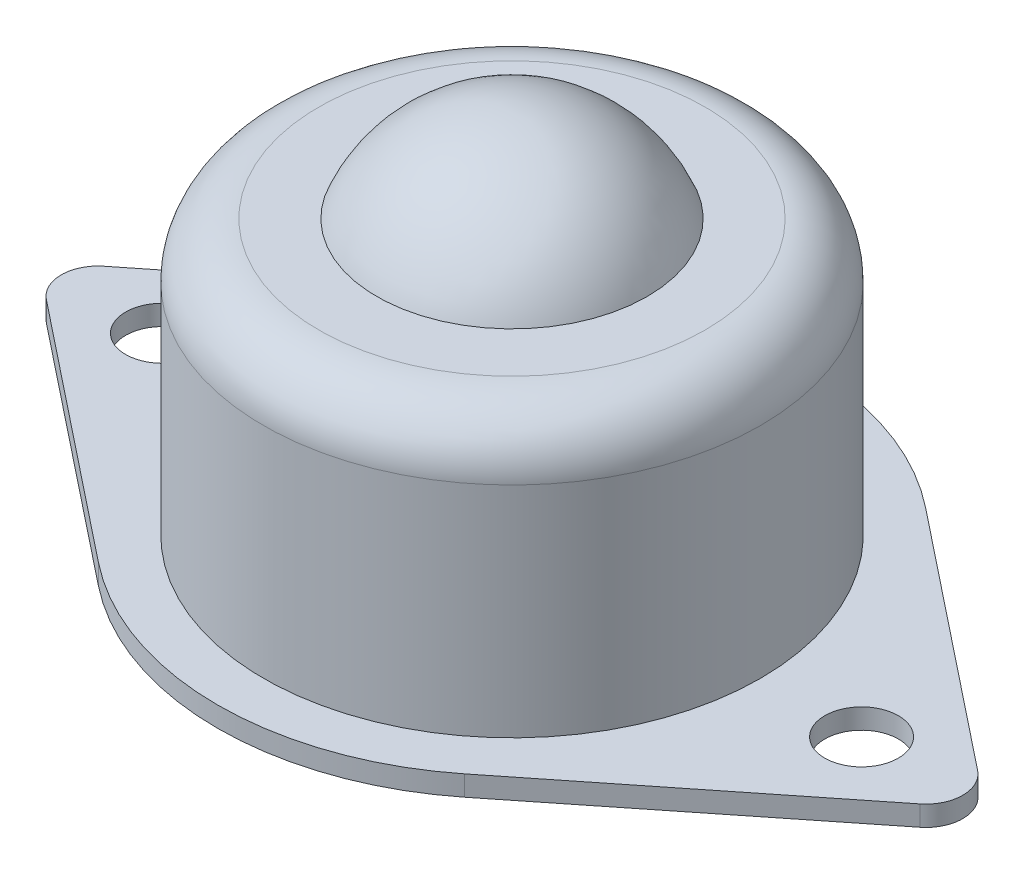
ISO-10303-21;
HEADER;
FILE_DESCRIPTION(('STEP AP214'),'2;1');
FILE_NAME('part.step','',(''),(''),'','','');
FILE_SCHEMA(('AUTOMOTIVE_DESIGN { 1 0 10303 214 1 1 1 1 }'));
ENDSEC;
DATA;
#1=APPLICATION_CONTEXT('core data for automotive mechanical design processes');
#2=APPLICATION_PROTOCOL_DEFINITION('international standard','automotive_design',2000,#1);
#3=PRODUCT_CONTEXT('',#1,'mechanical');
#4=PRODUCT('Part','Part','',(#3));
#5=PRODUCT_RELATED_PRODUCT_CATEGORY('part','',(#4));
#6=PRODUCT_DEFINITION_FORMATION('','',#4);
#7=PRODUCT_DEFINITION_CONTEXT('part definition',#1,'design');
#8=PRODUCT_DEFINITION('design','',#6,#7);
#9=PRODUCT_DEFINITION_SHAPE('','',#8);
#10=(LENGTH_UNIT() NAMED_UNIT(*) SI_UNIT(.MILLI.,.METRE.));
#11=(NAMED_UNIT(*) PLANE_ANGLE_UNIT() SI_UNIT($,.RADIAN.));
#12=(NAMED_UNIT(*) SI_UNIT($,.STERADIAN.) SOLID_ANGLE_UNIT());
#13=UNCERTAINTY_MEASURE_WITH_UNIT(LENGTH_MEASURE(1.E-05),#10,'distance_accuracy_value','');
#14=(GEOMETRIC_REPRESENTATION_CONTEXT(3) GLOBAL_UNCERTAINTY_ASSIGNED_CONTEXT((#13)) GLOBAL_UNIT_ASSIGNED_CONTEXT((#10,
#11,#12)) REPRESENTATION_CONTEXT('',''));
#15=CARTESIAN_POINT('',(0.,0.,0.));
#16=DIRECTION('',(0.,0.,1.));
#17=DIRECTION('',(1.,0.,0.));
#18=AXIS2_PLACEMENT_3D('',#15,#16,#17);
#19=CARTESIAN_POINT('',(0.,1.1,0.));
#20=DIRECTION('',(0.,1.,0.));
#21=DIRECTION('',(0.,0.,1.));
#22=AXIS2_PLACEMENT_3D('',#19,#20,#21);
#23=PLANE('',#22);
#24=CARTESIAN_POINT('',(19.,1.1,0.));
#25=DIRECTION('',(0.,1.,0.));
#26=DIRECTION('',(0.,0.,-1.));
#27=AXIS2_PLACEMENT_3D('',#24,#25,#26);
#28=CIRCLE('',#27,2.);
#29=CARTESIAN_POINT('',(19.,1.1,-2.00000000000001));
#30=VERTEX_POINT('',#29);
#31=EDGE_CURVE('E184',#30,#30,#28,.T.);
#32=ORIENTED_EDGE('',*,*,#31,.F.);
#33=EDGE_LOOP('',(#32));
#34=FACE_BOUND('',#33,.T.);
#35=CARTESIAN_POINT('',(0.,1.1,0.));
#36=DIRECTION('',(0.,1.,0.));
#37=DIRECTION('',(0.,0.,1.));
#38=AXIS2_PLACEMENT_3D('',#35,#36,#37);
#39=CIRCLE('',#38,16.);
#40=CARTESIAN_POINT('',(9.95555555555555,1.1,-12.5254506338194));
#41=VERTEX_POINT('',#40);
#42=CARTESIAN_POINT('',(-9.95555555555556,1.1,-12.5254506338194));
#43=VERTEX_POINT('',#42);
#44=EDGE_CURVE('E147',#41,#43,#39,.T.);
#45=ORIENTED_EDGE('',*,*,#44,.T.);
#46=DIRECTION('',(-0.782840664613713,0.,0.622222222222222));
#47=VECTOR('',#46,1.);
#48=CARTESIAN_POINT('',(-9.95555555555556,1.1,-12.5254506338194));
#49=LINE('',#48,#47);
#50=CARTESIAN_POINT('',(-23.7444444444444,1.1,-1.56568132922743));
#51=VERTEX_POINT('',#50);
#52=EDGE_CURVE('E95',#43,#51,#49,.T.);
#53=ORIENTED_EDGE('',*,*,#52,.T.);
#54=CARTESIAN_POINT('',(-22.5,1.1,0.));
#55=DIRECTION('',(0.,1.,0.));
#56=DIRECTION('',(0.,0.,1.));
#57=AXIS2_PLACEMENT_3D('',#54,#55,#56);
#58=CIRCLE('',#57,2.);
#59=CARTESIAN_POINT('',(-23.7444444444444,1.1,1.56568132922743));
#60=VERTEX_POINT('',#59);
#61=EDGE_CURVE('E162',#51,#60,#58,.T.);
#62=ORIENTED_EDGE('',*,*,#61,.T.);
#63=DIRECTION('',(0.782840664613713,0.,0.622222222222222));
#64=VECTOR('',#63,1.);
#65=CARTESIAN_POINT('',(-9.95555555555556,1.1,12.5254506338194));
#66=LINE('',#65,#64);
#67=CARTESIAN_POINT('',(-9.95555555555556,1.1,12.5254506338194));
#68=VERTEX_POINT('',#67);
#69=EDGE_CURVE('E175',#60,#68,#66,.T.);
#70=ORIENTED_EDGE('',*,*,#69,.T.);
#71=CARTESIAN_POINT('',(0.,1.1,0.));
#72=DIRECTION('',(0.,1.,0.));
#73=DIRECTION('',(0.,0.,1.));
#74=AXIS2_PLACEMENT_3D('',#71,#72,#73);
#75=CIRCLE('',#74,16.);
#76=CARTESIAN_POINT('',(9.95555555555555,1.1,12.5254506338194));
#77=VERTEX_POINT('',#76);
#78=EDGE_CURVE('E114',#68,#77,#75,.T.);
#79=ORIENTED_EDGE('',*,*,#78,.T.);
#80=DIRECTION('',(0.782840664613713,0.,-0.622222222222222));
#81=VECTOR('',#80,1.);
#82=CARTESIAN_POINT('',(9.95555555555556,1.1,12.5254506338194));
#83=LINE('',#82,#81);
#84=CARTESIAN_POINT('',(23.7444444444444,1.1,1.56568132922743));
#85=VERTEX_POINT('',#84);
#86=EDGE_CURVE('E108',#77,#85,#83,.T.);
#87=ORIENTED_EDGE('',*,*,#86,.T.);
#88=CARTESIAN_POINT('',(22.5,1.1,0.));
#89=DIRECTION('',(0.,1.,0.));
#90=DIRECTION('',(0.,0.,-1.));
#91=AXIS2_PLACEMENT_3D('',#88,#89,#90);
#92=CIRCLE('',#91,2.00000000000001);
#93=CARTESIAN_POINT('',(23.7444444444445,1.1,-1.56568132922744));
#94=VERTEX_POINT('',#93);
#95=EDGE_CURVE('E112',#85,#94,#92,.T.);
#96=ORIENTED_EDGE('',*,*,#95,.T.);
#97=DIRECTION('',(-0.782840664613713,0.,-0.622222222222222));
#98=VECTOR('',#97,1.);
#99=CARTESIAN_POINT('',(9.95555555555555,1.1,-12.5254506338194));
#100=LINE('',#99,#98);
#101=EDGE_CURVE('E52',#94,#41,#100,.T.);
#102=ORIENTED_EDGE('',*,*,#101,.T.);
#103=EDGE_LOOP('',(#45,#53,#62,#70,#79,#87,#96,#102));
#104=FACE_BOUND('',#103,.T.);
#105=CARTESIAN_POINT('',(-19.,1.1,0.));
#106=DIRECTION('',(0.,1.,0.));
#107=DIRECTION('',(0.,0.,1.));
#108=AXIS2_PLACEMENT_3D('',#105,#106,#107);
#109=CIRCLE('',#108,2.);
#110=CARTESIAN_POINT('',(-19.,1.1,2.));
#111=VERTEX_POINT('',#110);
#112=EDGE_CURVE('E136',#111,#111,#109,.T.);
#113=ORIENTED_EDGE('',*,*,#112,.F.);
#114=EDGE_LOOP('',(#113));
#115=FACE_BOUND('',#114,.T.);
#116=CARTESIAN_POINT('',(0.,1.1,0.));
#117=DIRECTION('',(0.,-1.,0.));
#118=DIRECTION('',(1.,0.,0.));
#119=AXIS2_PLACEMENT_3D('',#116,#117,#118);
#120=CIRCLE('',#119,13.5);
#121=CARTESIAN_POINT('',(13.5,1.1,0.));
#122=VERTEX_POINT('',#121);
#123=EDGE_CURVE('E201',#122,#122,#120,.T.);
#124=ORIENTED_EDGE('',*,*,#123,.T.);
#125=EDGE_LOOP('',(#124));
#126=FACE_BOUND('',#125,.T.);
#127=ADVANCED_FACE('F35',(#34,#104,#115,#126),#23,.T.);
#128=CARTESIAN_POINT('',(0.,0.,0.));
#129=DIRECTION('',(0.,1.,0.));
#130=DIRECTION('',(0.,0.,1.));
#131=AXIS2_PLACEMENT_3D('',#128,#129,#130);
#132=PLANE('',#131);
#133=CARTESIAN_POINT('',(-19.,0.,0.));
#134=DIRECTION('',(0.,1.,0.));
#135=DIRECTION('',(0.,0.,1.));
#136=AXIS2_PLACEMENT_3D('',#133,#134,#135);
#137=CIRCLE('',#136,2.);
#138=CARTESIAN_POINT('',(-19.,0.,2.));
#139=VERTEX_POINT('',#138);
#140=EDGE_CURVE('E181',#139,#139,#137,.T.);
#141=ORIENTED_EDGE('',*,*,#140,.T.);
#142=EDGE_LOOP('',(#141));
#143=FACE_BOUND('',#142,.T.);
#144=CARTESIAN_POINT('',(0.,0.,0.));
#145=DIRECTION('',(0.,1.,0.));
#146=DIRECTION('',(0.,0.,1.));
#147=AXIS2_PLACEMENT_3D('',#144,#145,#146);
#148=CIRCLE('',#147,16.);
#149=CARTESIAN_POINT('',(9.95555555555555,0.,-12.5254506338194));
#150=VERTEX_POINT('',#149);
#151=CARTESIAN_POINT('',(-9.95555555555556,0.,-12.5254506338194));
#152=VERTEX_POINT('',#151);
#153=EDGE_CURVE('E132',#150,#152,#148,.T.);
#154=ORIENTED_EDGE('',*,*,#153,.F.);
#155=DIRECTION('',(-0.782840664613713,0.,-0.622222222222222));
#156=VECTOR('',#155,1.);
#157=CARTESIAN_POINT('',(9.95555555555555,0.,-12.5254506338194));
#158=LINE('',#157,#156);
#159=CARTESIAN_POINT('',(23.7444444444445,0.,-1.56568132922744));
#160=VERTEX_POINT('',#159);
#161=EDGE_CURVE('E87',#160,#150,#158,.T.);
#162=ORIENTED_EDGE('',*,*,#161,.F.);
#163=CARTESIAN_POINT('',(22.5,0.,0.));
#164=DIRECTION('',(0.,1.,0.));
#165=DIRECTION('',(0.,0.,-1.));
#166=AXIS2_PLACEMENT_3D('',#163,#164,#165);
#167=CIRCLE('',#166,2.00000000000001);
#168=CARTESIAN_POINT('',(23.7444444444444,0.,1.56568132922743));
#169=VERTEX_POINT('',#168);
#170=EDGE_CURVE('E81',#169,#160,#167,.T.);
#171=ORIENTED_EDGE('',*,*,#170,.F.);
#172=DIRECTION('',(0.782840664613713,0.,-0.622222222222222));
#173=VECTOR('',#172,1.);
#174=CARTESIAN_POINT('',(9.95555555555556,0.,12.5254506338194));
#175=LINE('',#174,#173);
#176=CARTESIAN_POINT('',(9.95555555555555,0.,12.5254506338194));
#177=VERTEX_POINT('',#176);
#178=EDGE_CURVE('E122',#177,#169,#175,.T.);
#179=ORIENTED_EDGE('',*,*,#178,.F.);
#180=CARTESIAN_POINT('',(0.,0.,0.));
#181=DIRECTION('',(0.,1.,0.));
#182=DIRECTION('',(0.,0.,1.));
#183=AXIS2_PLACEMENT_3D('',#180,#181,#182);
#184=CIRCLE('',#183,16.);
#185=CARTESIAN_POINT('',(-9.95555555555556,0.,12.5254506338194));
#186=VERTEX_POINT('',#185);
#187=EDGE_CURVE('E142',#186,#177,#184,.T.);
#188=ORIENTED_EDGE('',*,*,#187,.F.);
#189=DIRECTION('',(0.782840664613713,0.,0.622222222222222));
#190=VECTOR('',#189,1.);
#191=CARTESIAN_POINT('',(-9.95555555555556,0.,12.5254506338194));
#192=LINE('',#191,#190);
#193=CARTESIAN_POINT('',(-23.7444444444444,0.,1.56568132922743));
#194=VERTEX_POINT('',#193);
#195=EDGE_CURVE('E140',#194,#186,#192,.T.);
#196=ORIENTED_EDGE('',*,*,#195,.F.);
#197=CARTESIAN_POINT('',(-22.5,0.,0.));
#198=DIRECTION('',(0.,1.,0.));
#199=DIRECTION('',(0.,0.,1.));
#200=AXIS2_PLACEMENT_3D('',#197,#198,#199);
#201=CIRCLE('',#200,2.);
#202=CARTESIAN_POINT('',(-23.7444444444444,0.,-1.56568132922743));
#203=VERTEX_POINT('',#202);
#204=EDGE_CURVE('E138',#203,#194,#201,.T.);
#205=ORIENTED_EDGE('',*,*,#204,.F.);
#206=DIRECTION('',(-0.782840664613713,0.,0.622222222222222));
#207=VECTOR('',#206,1.);
#208=CARTESIAN_POINT('',(-9.95555555555556,0.,-12.5254506338194));
#209=LINE('',#208,#207);
#210=EDGE_CURVE('E135',#152,#203,#209,.T.);
#211=ORIENTED_EDGE('',*,*,#210,.F.);
#212=EDGE_LOOP('',(#154,#162,#171,#179,#188,#196,#205,#211));
#213=FACE_BOUND('',#212,.T.);
#214=CARTESIAN_POINT('',(19.,0.,0.));
#215=DIRECTION('',(0.,1.,0.));
#216=DIRECTION('',(0.,0.,-1.));
#217=AXIS2_PLACEMENT_3D('',#214,#215,#216);
#218=CIRCLE('',#217,2.);
#219=CARTESIAN_POINT('',(19.,0.,-2.00000000000001));
#220=VERTEX_POINT('',#219);
#221=EDGE_CURVE('E187',#220,#220,#218,.T.);
#222=ORIENTED_EDGE('',*,*,#221,.T.);
#223=EDGE_LOOP('',(#222));
#224=FACE_BOUND('',#223,.T.);
#225=ADVANCED_FACE('F166',(#143,#213,#224),#132,.F.);
#226=CARTESIAN_POINT('',(0.,1.1,0.));
#227=DIRECTION('',(0.,-1.,0.));
#228=DIRECTION('',(0.,0.,-1.));
#229=AXIS2_PLACEMENT_3D('',#226,#227,#228);
#230=CYLINDRICAL_SURFACE('',#229,16.);
#231=ORIENTED_EDGE('',*,*,#153,.T.);
#232=DIRECTION('',(0.,-1.,0.));
#233=VECTOR('',#232,1.);
#234=CARTESIAN_POINT('',(-9.95555555555556,1.1,-12.5254506338194));
#235=LINE('',#234,#233);
#236=EDGE_CURVE('E11',#43,#152,#235,.T.);
#237=ORIENTED_EDGE('',*,*,#236,.F.);
#238=ORIENTED_EDGE('',*,*,#44,.F.);
#239=DIRECTION('',(0.,-1.,0.));
#240=VECTOR('',#239,1.);
#241=CARTESIAN_POINT('',(9.95555555555555,1.1,-12.5254506338194));
#242=LINE('',#241,#240);
#243=EDGE_CURVE('E128',#41,#150,#242,.T.);
#244=ORIENTED_EDGE('',*,*,#243,.T.);
#245=EDGE_LOOP('',(#231,#237,#238,#244));
#246=FACE_BOUND('',#245,.T.);
#247=ADVANCED_FACE('F37',(#246),#230,.T.);
#248=CARTESIAN_POINT('',(-9.95555555555556,1.1,-12.5254506338194));
#249=DIRECTION('',(0.622222222222222,0.,0.782840664613713));
#250=DIRECTION('',(0.782840664613713,0.,-0.622222222222222));
#251=AXIS2_PLACEMENT_3D('',#248,#249,#250);
#252=PLANE('',#251);
#253=ORIENTED_EDGE('',*,*,#210,.T.);
#254=DIRECTION('',(0.,-1.,0.));
#255=VECTOR('',#254,1.);
#256=CARTESIAN_POINT('',(-23.7444444444444,1.1,-1.56568132922743));
#257=LINE('',#256,#255);
#258=EDGE_CURVE('E44',#51,#203,#257,.T.);
#259=ORIENTED_EDGE('',*,*,#258,.F.);
#260=ORIENTED_EDGE('',*,*,#52,.F.);
#261=ORIENTED_EDGE('',*,*,#236,.T.);
#262=EDGE_LOOP('',(#253,#259,#260,#261));
#263=FACE_BOUND('',#262,.T.);
#264=ADVANCED_FACE('F257',(#263),#252,.F.);
#265=CARTESIAN_POINT('',(-22.5,1.1,0.));
#266=DIRECTION('',(0.,-1.,0.));
#267=DIRECTION('',(0.,0.,-1.));
#268=AXIS2_PLACEMENT_3D('',#265,#266,#267);
#269=CYLINDRICAL_SURFACE('',#268,2.);
#270=ORIENTED_EDGE('',*,*,#204,.T.);
#271=DIRECTION('',(0.,-1.,0.));
#272=VECTOR('',#271,1.);
#273=CARTESIAN_POINT('',(-23.7444444444444,1.1,1.56568132922743));
#274=LINE('',#273,#272);
#275=EDGE_CURVE('E154',#60,#194,#274,.T.);
#276=ORIENTED_EDGE('',*,*,#275,.F.);
#277=ORIENTED_EDGE('',*,*,#61,.F.);
#278=ORIENTED_EDGE('',*,*,#258,.T.);
#279=EDGE_LOOP('',(#270,#276,#277,#278));
#280=FACE_BOUND('',#279,.T.);
#281=ADVANCED_FACE('F160',(#280),#269,.T.);
#282=CARTESIAN_POINT('',(-9.95555555555556,1.1,12.5254506338194));
#283=DIRECTION('',(0.622222222222222,0.,-0.782840664613713));
#284=DIRECTION('',(-0.782840664613713,0.,-0.622222222222222));
#285=AXIS2_PLACEMENT_3D('',#282,#283,#284);
#286=PLANE('',#285);
#287=ORIENTED_EDGE('',*,*,#195,.T.);
#288=DIRECTION('',(0.,-1.,0.));
#289=VECTOR('',#288,1.);
#290=CARTESIAN_POINT('',(-9.95555555555556,1.1,12.5254506338194));
#291=LINE('',#290,#289);
#292=EDGE_CURVE('E151',#68,#186,#291,.T.);
#293=ORIENTED_EDGE('',*,*,#292,.F.);
#294=ORIENTED_EDGE('',*,*,#69,.F.);
#295=ORIENTED_EDGE('',*,*,#275,.T.);
#296=EDGE_LOOP('',(#287,#293,#294,#295));
#297=FACE_BOUND('',#296,.T.);
#298=ADVANCED_FACE('F171',(#297),#286,.F.);
#299=CARTESIAN_POINT('',(0.,1.1,0.));
#300=DIRECTION('',(0.,-1.,0.));
#301=DIRECTION('',(0.,0.,-1.));
#302=AXIS2_PLACEMENT_3D('',#299,#300,#301);
#303=CYLINDRICAL_SURFACE('',#302,16.);
#304=ORIENTED_EDGE('',*,*,#187,.T.);
#305=DIRECTION('',(0.,-1.,0.));
#306=VECTOR('',#305,1.);
#307=CARTESIAN_POINT('',(9.95555555555555,1.1,12.5254506338194));
#308=LINE('',#307,#306);
#309=EDGE_CURVE('E123',#77,#177,#308,.T.);
#310=ORIENTED_EDGE('',*,*,#309,.F.);
#311=ORIENTED_EDGE('',*,*,#78,.F.);
#312=ORIENTED_EDGE('',*,*,#292,.T.);
#313=EDGE_LOOP('',(#304,#310,#311,#312));
#314=FACE_BOUND('',#313,.T.);
#315=ADVANCED_FACE('F174',(#314),#303,.T.);
#316=CARTESIAN_POINT('',(9.95555555555556,1.1,12.5254506338194));
#317=DIRECTION('',(-0.622222222222222,0.,-0.782840664613713));
#318=DIRECTION('',(-0.782840664613713,0.,0.622222222222222));
#319=AXIS2_PLACEMENT_3D('',#316,#317,#318);
#320=PLANE('',#319);
#321=ORIENTED_EDGE('',*,*,#178,.T.);
#322=DIRECTION('',(0.,-1.,0.));
#323=VECTOR('',#322,1.);
#324=CARTESIAN_POINT('',(23.7444444444444,1.1,1.56568132922743));
#325=LINE('',#324,#323);
#326=EDGE_CURVE('E119',#85,#169,#325,.T.);
#327=ORIENTED_EDGE('',*,*,#326,.F.);
#328=ORIENTED_EDGE('',*,*,#86,.F.);
#329=ORIENTED_EDGE('',*,*,#309,.T.);
#330=EDGE_LOOP('',(#321,#327,#328,#329));
#331=FACE_BOUND('',#330,.T.);
#332=ADVANCED_FACE('F120',(#331),#320,.F.);
#333=CARTESIAN_POINT('',(22.5,1.1,0.));
#334=DIRECTION('',(0.,-1.,0.));
#335=DIRECTION('',(0.,0.,-1.));
#336=AXIS2_PLACEMENT_3D('',#333,#334,#335);
#337=CYLINDRICAL_SURFACE('',#336,2.00000000000001);
#338=ORIENTED_EDGE('',*,*,#170,.T.);
#339=DIRECTION('',(0.,-1.,0.));
#340=VECTOR('',#339,1.);
#341=CARTESIAN_POINT('',(23.7444444444445,1.1,-1.56568132922744));
#342=LINE('',#341,#340);
#343=EDGE_CURVE('E124',#94,#160,#342,.T.);
#344=ORIENTED_EDGE('',*,*,#343,.F.);
#345=ORIENTED_EDGE('',*,*,#95,.F.);
#346=ORIENTED_EDGE('',*,*,#326,.T.);
#347=EDGE_LOOP('',(#338,#344,#345,#346));
#348=FACE_BOUND('',#347,.T.);
#349=ADVANCED_FACE('F126',(#348),#337,.T.);
#350=CARTESIAN_POINT('',(9.95555555555555,1.1,-12.5254506338194));
#351=DIRECTION('',(-0.622222222222222,0.,0.782840664613713));
#352=DIRECTION('',(0.782840664613713,0.,0.622222222222222));
#353=AXIS2_PLACEMENT_3D('',#350,#351,#352);
#354=PLANE('',#353);
#355=ORIENTED_EDGE('',*,*,#161,.T.);
#356=ORIENTED_EDGE('',*,*,#243,.F.);
#357=ORIENTED_EDGE('',*,*,#101,.F.);
#358=ORIENTED_EDGE('',*,*,#343,.T.);
#359=EDGE_LOOP('',(#355,#356,#357,#358));
#360=FACE_BOUND('',#359,.T.);
#361=ADVANCED_FACE('F245',(#360),#354,.F.);
#362=CARTESIAN_POINT('',(-19.,1.1,0.));
#363=DIRECTION('',(0.,-1.,0.));
#364=DIRECTION('',(0.,0.,-1.));
#365=AXIS2_PLACEMENT_3D('',#362,#363,#364);
#366=CYLINDRICAL_SURFACE('',#365,2.);
#367=ORIENTED_EDGE('',*,*,#112,.T.);
#368=EDGE_LOOP('',(#367));
#369=FACE_BOUND('',#368,.T.);
#370=ORIENTED_EDGE('',*,*,#140,.F.);
#371=EDGE_LOOP('',(#370));
#372=FACE_BOUND('',#371,.T.);
#373=ADVANCED_FACE('F231',(#369,#372),#366,.F.);
#374=CARTESIAN_POINT('',(19.,1.1,0.));
#375=DIRECTION('',(0.,-1.,0.));
#376=DIRECTION('',(0.,0.,-1.));
#377=AXIS2_PLACEMENT_3D('',#374,#375,#376);
#378=CYLINDRICAL_SURFACE('',#377,2.);
#379=ORIENTED_EDGE('',*,*,#31,.T.);
#380=EDGE_LOOP('',(#379));
#381=FACE_BOUND('',#380,.T.);
#382=ORIENTED_EDGE('',*,*,#221,.F.);
#383=EDGE_LOOP('',(#382));
#384=FACE_BOUND('',#383,.T.);
#385=ADVANCED_FACE('F226',(#381,#384),#378,.F.);
#386=CARTESIAN_POINT('',(0.,13.1,0.));
#387=DIRECTION('',(0.,-1.,0.));
#388=DIRECTION('',(-1.,0.,0.));
#389=AXIS2_PLACEMENT_3D('',#386,#387,#388);
#390=SPHERICAL_SURFACE('',#389,7.9);
#391=CARTESIAN_POINT('',(0.,16.,0.));
#392=DIRECTION('',(0.,-1.,0.));
#393=DIRECTION('',(1.,0.,0.));
#394=AXIS2_PLACEMENT_3D('',#391,#392,#393);
#395=CIRCLE('',#394,7.34846922834953);
#396=CARTESIAN_POINT('',(7.34846922834953,16.,0.));
#397=VERTEX_POINT('',#396);
#398=EDGE_CURVE('E190',#397,#397,#395,.T.);
#399=ORIENTED_EDGE('',*,*,#398,.F.);
#400=EDGE_LOOP('',(#399));
#401=FACE_BOUND('',#400,.T.);
#402=ADVANCED_FACE('F221',(#401),#390,.T.);
#403=CARTESIAN_POINT('',(-10.5,16.,0.));
#404=DIRECTION('',(0.,-1.,0.));
#405=DIRECTION('',(1.,0.,0.));
#406=AXIS2_PLACEMENT_3D('',#403,#404,#405);
#407=PLANE('',#406);
#408=CARTESIAN_POINT('',(0.,16.,0.));
#409=DIRECTION('',(0.,-1.,0.));
#410=DIRECTION('',(1.,0.,0.));
#411=AXIS2_PLACEMENT_3D('',#408,#409,#410);
#412=CIRCLE('',#411,10.5);
#413=CARTESIAN_POINT('',(10.5,16.,0.));
#414=VERTEX_POINT('',#413);
#415=EDGE_CURVE('E195',#414,#414,#412,.T.);
#416=ORIENTED_EDGE('',*,*,#415,.F.);
#417=EDGE_LOOP('',(#416));
#418=FACE_BOUND('',#417,.T.);
#419=ORIENTED_EDGE('',*,*,#398,.T.);
#420=EDGE_LOOP('',(#419));
#421=FACE_BOUND('',#420,.T.);
#422=ADVANCED_FACE('F215',(#418,#421),#407,.F.);
#423=CARTESIAN_POINT('',(0.,13.,0.));
#424=DIRECTION('',(0.,-1.,0.));
#425=DIRECTION('',(1.,0.,0.));
#426=AXIS2_PLACEMENT_3D('',#423,#424,#425);
#427=TOROIDAL_SURFACE('',#426,10.5,3.);
#428=CARTESIAN_POINT('',(0.,13.,0.));
#429=DIRECTION('',(0.,-1.,0.));
#430=DIRECTION('',(1.,0.,0.));
#431=AXIS2_PLACEMENT_3D('',#428,#429,#430);
#432=CIRCLE('',#431,13.5);
#433=CARTESIAN_POINT('',(13.5,13.,0.));
#434=VERTEX_POINT('',#433);
#435=EDGE_CURVE('E198',#434,#434,#432,.T.);
#436=ORIENTED_EDGE('',*,*,#435,.F.);
#437=EDGE_LOOP('',(#436));
#438=FACE_BOUND('',#437,.T.);
#439=ORIENTED_EDGE('',*,*,#415,.T.);
#440=EDGE_LOOP('',(#439));
#441=FACE_BOUND('',#440,.T.);
#442=ADVANCED_FACE('F209',(#438,#441),#427,.T.);
#443=CARTESIAN_POINT('',(0.,1.1,0.));
#444=DIRECTION('',(0.,-1.,0.));
#445=DIRECTION('',(1.,0.,0.));
#446=AXIS2_PLACEMENT_3D('',#443,#444,#445);
#447=CYLINDRICAL_SURFACE('',#446,13.5);
#448=ORIENTED_EDGE('',*,*,#123,.F.);
#449=EDGE_LOOP('',(#448));
#450=FACE_BOUND('',#449,.T.);
#451=ORIENTED_EDGE('',*,*,#435,.T.);
#452=EDGE_LOOP('',(#451));
#453=FACE_BOUND('',#452,.T.);
#454=ADVANCED_FACE('F206',(#450,#453),#447,.T.);
#455=CLOSED_SHELL('',(#127,#225,#247,#264,#281,#298,#315,#332,#349,#361,#373,#385,#402,#422,
#442,#454));
#456=MANIFOLD_SOLID_BREP('B2',#455);
#457=ADVANCED_BREP_SHAPE_REPRESENTATION('',(#18,#456),#14);
#458=SHAPE_DEFINITION_REPRESENTATION(#9,#457);
ENDSEC;
END-ISO-10303-21;
